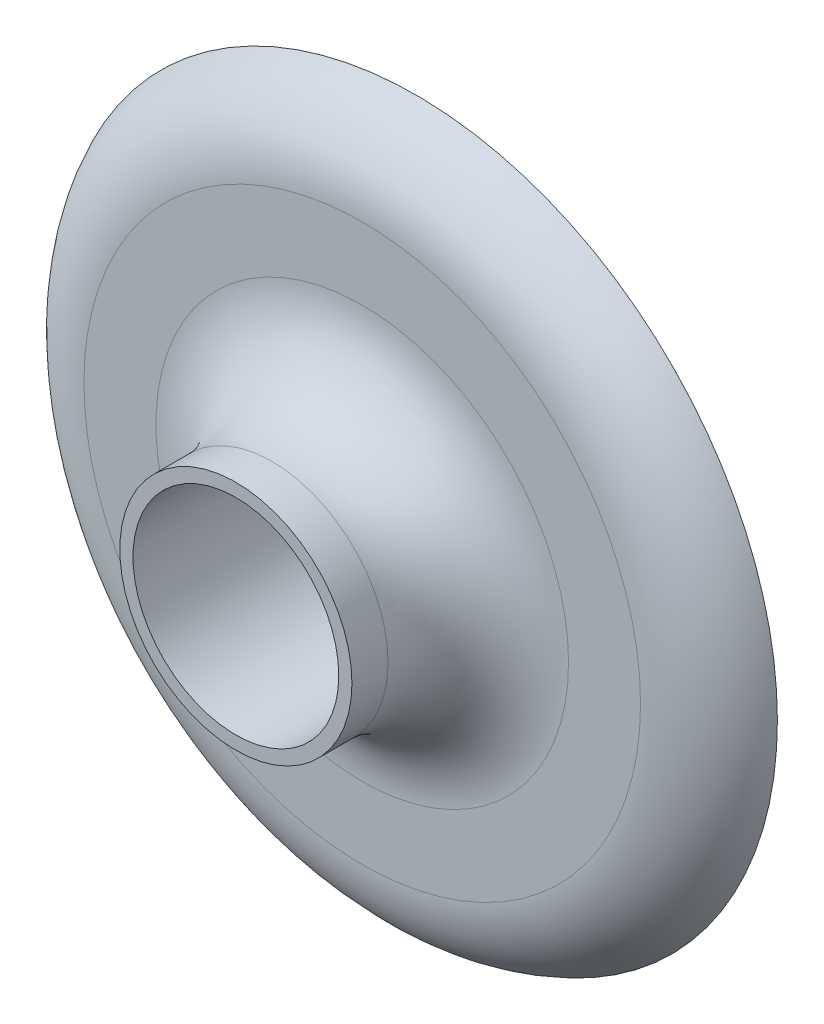
ISO-10303-21;
HEADER;
FILE_DESCRIPTION(('STEP AP214'),'2;1');
FILE_NAME('part.step','',(''),(''),'','','');
FILE_SCHEMA(('AUTOMOTIVE_DESIGN { 1 0 10303 214 1 1 1 1 }'));
ENDSEC;
DATA;
#1=APPLICATION_CONTEXT('core data for automotive mechanical design processes');
#2=APPLICATION_PROTOCOL_DEFINITION('international standard','automotive_design',2000,#1);
#3=PRODUCT_CONTEXT('',#1,'mechanical');
#4=PRODUCT('Part','Part','',(#3));
#5=PRODUCT_RELATED_PRODUCT_CATEGORY('part','',(#4));
#6=PRODUCT_DEFINITION_FORMATION('','',#4);
#7=PRODUCT_DEFINITION_CONTEXT('part definition',#1,'design');
#8=PRODUCT_DEFINITION('design','',#6,#7);
#9=PRODUCT_DEFINITION_SHAPE('','',#8);
#10=(LENGTH_UNIT() NAMED_UNIT(*) SI_UNIT(.MILLI.,.METRE.));
#11=(NAMED_UNIT(*) PLANE_ANGLE_UNIT() SI_UNIT($,.RADIAN.));
#12=(NAMED_UNIT(*) SI_UNIT($,.STERADIAN.) SOLID_ANGLE_UNIT());
#13=UNCERTAINTY_MEASURE_WITH_UNIT(LENGTH_MEASURE(1.E-05),#10,'distance_accuracy_value','');
#14=(GEOMETRIC_REPRESENTATION_CONTEXT(3) GLOBAL_UNCERTAINTY_ASSIGNED_CONTEXT((#13)) GLOBAL_UNIT_ASSIGNED_CONTEXT((#10,
#11,#12)) REPRESENTATION_CONTEXT('',''));
#15=CARTESIAN_POINT('',(0.,0.,0.));
#16=DIRECTION('',(0.,0.,1.));
#17=DIRECTION('',(1.,0.,0.));
#18=AXIS2_PLACEMENT_3D('',#15,#16,#17);
#19=CARTESIAN_POINT('',(-23.3230296363414,24.1352744495473,25.4));
#20=DIRECTION('',(0.,0.,1.));
#21=DIRECTION('',(1.,0.,0.));
#22=AXIS2_PLACEMENT_3D('',#19,#20,#21);
#23=PLANE('',#22);
#24=CARTESIAN_POINT('',(-23.3230296363414,24.1352744495473,25.4));
#25=DIRECTION('',(0.,0.,1.));
#26=DIRECTION('',(1.,0.,0.));
#27=AXIS2_PLACEMENT_3D('',#24,#25,#26);
#28=CIRCLE('',#27,14.478);
#29=CARTESIAN_POINT('',(-8.84502963634141,24.1352744495473,25.4));
#30=VERTEX_POINT('',#29);
#31=EDGE_CURVE('E63',#30,#30,#28,.T.);
#32=ORIENTED_EDGE('',*,*,#31,.F.);
#33=EDGE_LOOP('',(#32));
#34=FACE_BOUND('',#33,.T.);
#35=CARTESIAN_POINT('',(-23.3230296363414,24.1352744495473,25.4));
#36=DIRECTION('',(0.,0.,1.));
#37=DIRECTION('',(1.,0.,0.));
#38=AXIS2_PLACEMENT_3D('',#35,#36,#37);
#39=CIRCLE('',#38,16.3330665692986);
#40=CARTESIAN_POINT('',(-6.98996306704278,24.1352744495473,25.4));
#41=VERTEX_POINT('',#40);
#42=EDGE_CURVE('E67',#41,#41,#39,.T.);
#43=ORIENTED_EDGE('',*,*,#42,.T.);
#44=EDGE_LOOP('',(#43));
#45=FACE_BOUND('',#44,.T.);
#46=ADVANCED_FACE('F38',(#34,#45),#23,.T.);
#47=CARTESIAN_POINT('',(-23.3230296363414,24.1352744495473,0.));
#48=DIRECTION('',(0.,0.,1.));
#49=DIRECTION('',(1.,0.,0.));
#50=AXIS2_PLACEMENT_3D('',#47,#48,#49);
#51=PLANE('',#50);
#52=CARTESIAN_POINT('',(-23.3230296363414,24.1352744495473,0.));
#53=DIRECTION('',(0.,0.,1.));
#54=DIRECTION('',(1.,0.,0.));
#55=AXIS2_PLACEMENT_3D('',#52,#53,#54);
#56=CIRCLE('',#55,14.478);
#57=CARTESIAN_POINT('',(-8.84502963634141,24.1352744495473,0.));
#58=VERTEX_POINT('',#57);
#59=EDGE_CURVE('E62',#58,#58,#56,.T.);
#60=ORIENTED_EDGE('',*,*,#59,.T.);
#61=EDGE_LOOP('',(#60));
#62=FACE_BOUND('',#61,.T.);
#63=CARTESIAN_POINT('',(-23.3230296363414,24.1352744495473,0.));
#64=DIRECTION('',(0.,0.,1.));
#65=DIRECTION('',(1.,0.,0.));
#66=AXIS2_PLACEMENT_3D('',#63,#64,#65);
#67=CIRCLE('',#66,50.8);
#68=CARTESIAN_POINT('',(27.4769703636586,24.1352744495473,0.));
#69=VERTEX_POINT('',#68);
#70=EDGE_CURVE('E56',#69,#69,#67,.T.);
#71=ORIENTED_EDGE('',*,*,#70,.F.);
#72=EDGE_LOOP('',(#71));
#73=FACE_BOUND('',#72,.T.);
#74=ADVANCED_FACE('F90',(#62,#73),#51,.F.);
#75=CARTESIAN_POINT('',(-23.3230296363414,24.1352744495473,0.));
#76=DIRECTION('',(0.,0.,1.));
#77=DIRECTION('',(1.,0.,0.));
#78=AXIS2_PLACEMENT_3D('',#75,#76,#77);
#79=CYLINDRICAL_SURFACE('',#78,14.478);
#80=ORIENTED_EDGE('',*,*,#59,.F.);
#81=EDGE_LOOP('',(#80));
#82=FACE_BOUND('',#81,.T.);
#83=ORIENTED_EDGE('',*,*,#31,.T.);
#84=EDGE_LOOP('',(#83));
#85=FACE_BOUND('',#84,.T.);
#86=ADVANCED_FACE('F87',(#82,#85),#79,.F.);
#87=CARTESIAN_POINT('',(-23.3230296363414,24.1352744495473,7.62));
#88=DIRECTION('',(0.,0.,1.));
#89=DIRECTION('',(1.,0.,0.));
#90=AXIS2_PLACEMENT_3D('',#87,#88,#89);
#91=PLANE('',#90);
#92=CARTESIAN_POINT('',(-23.3230296363414,24.1352744495473,7.62));
#93=DIRECTION('',(0.,0.,1.));
#94=DIRECTION('',(1.,0.,0.));
#95=AXIS2_PLACEMENT_3D('',#92,#93,#94);
#96=CIRCLE('',#95,39.1602577348122);
#97=CARTESIAN_POINT('',(15.8372280984707,24.1352744495473,7.62));
#98=VERTEX_POINT('',#97);
#99=EDGE_CURVE('E11',#98,#98,#96,.T.);
#100=ORIENTED_EDGE('',*,*,#99,.T.);
#101=EDGE_LOOP('',(#100));
#102=FACE_BOUND('',#101,.T.);
#103=CARTESIAN_POINT('',(-23.3230296363414,24.1352744495473,7.62));
#104=DIRECTION('',(0.,0.,1.));
#105=DIRECTION('',(1.,0.,0.));
#106=AXIS2_PLACEMENT_3D('',#103,#104,#105);
#107=CIRCLE('',#106,29.0330665692986);
#108=CARTESIAN_POINT('',(5.71003693295722,24.1352744495473,7.62));
#109=VERTEX_POINT('',#108);
#110=EDGE_CURVE('E46',#109,#109,#107,.F.);
#111=ORIENTED_EDGE('',*,*,#110,.T.);
#112=EDGE_LOOP('',(#111));
#113=FACE_BOUND('',#112,.T.);
#114=ADVANCED_FACE('F79',(#102,#113),#91,.T.);
#115=CARTESIAN_POINT('',(-23.3230296363414,24.1352744495473,7.62));
#116=DIRECTION('',(0.,0.,1.));
#117=DIRECTION('',(1.,0.,0.));
#118=AXIS2_PLACEMENT_3D('',#115,#116,#117);
#119=CYLINDRICAL_SURFACE('',#118,16.3330665692986);
#120=CARTESIAN_POINT('',(-23.3230296363414,24.1352744495473,20.32));
#121=DIRECTION('',(0.,0.,1.));
#122=DIRECTION('',(1.,0.,0.));
#123=AXIS2_PLACEMENT_3D('',#120,#121,#122);
#124=CIRCLE('',#123,16.3330665692986);
#125=CARTESIAN_POINT('',(-6.98996306704278,24.1352744495473,20.32));
#126=VERTEX_POINT('',#125);
#127=EDGE_CURVE('E51',#126,#126,#124,.T.);
#128=ORIENTED_EDGE('',*,*,#127,.T.);
#129=EDGE_LOOP('',(#128));
#130=FACE_BOUND('',#129,.T.);
#131=ORIENTED_EDGE('',*,*,#42,.F.);
#132=EDGE_LOOP('',(#131));
#133=FACE_BOUND('',#132,.T.);
#134=ADVANCED_FACE('F76',(#130,#133),#119,.T.);
#135=CARTESIAN_POINT('',(-23.3230296363414,24.1352744495473,20.32));
#136=DIRECTION('',(0.,0.,1.));
#137=DIRECTION('',(1.,0.,0.));
#138=AXIS2_PLACEMENT_3D('',#135,#136,#137);
#139=TOROIDAL_SURFACE('',#138,29.0330665692986,12.7);
#140=ORIENTED_EDGE('',*,*,#110,.F.);
#141=EDGE_LOOP('',(#140));
#142=FACE_BOUND('',#141,.T.);
#143=ORIENTED_EDGE('',*,*,#127,.F.);
#144=EDGE_LOOP('',(#143));
#145=FACE_BOUND('',#144,.T.);
#146=ADVANCED_FACE('F78',(#142,#145),#139,.F.);
#147=CARTESIAN_POINT('',(-23.3230296363414,24.1352744495473,-5.08));
#148=DIRECTION('',(0.,0.,-1.));
#149=DIRECTION('',(-1.,0.,0.));
#150=AXIS2_PLACEMENT_3D('',#147,#148,#149);
#151=TOROIDAL_SURFACE('',#150,39.1602577348122,12.7);
#152=ORIENTED_EDGE('',*,*,#70,.T.);
#153=EDGE_LOOP('',(#152));
#154=FACE_BOUND('',#153,.T.);
#155=ORIENTED_EDGE('',*,*,#99,.F.);
#156=EDGE_LOOP('',(#155));
#157=FACE_BOUND('',#156,.T.);
#158=ADVANCED_FACE('F40',(#154,#157),#151,.T.);
#159=CLOSED_SHELL('',(#46,#74,#86,#114,#134,#146,#158));
#160=MANIFOLD_SOLID_BREP('B2',#159);
#161=ADVANCED_BREP_SHAPE_REPRESENTATION('',(#18,#160),#14);
#162=SHAPE_DEFINITION_REPRESENTATION(#9,#161);
ENDSEC;
END-ISO-10303-21;
